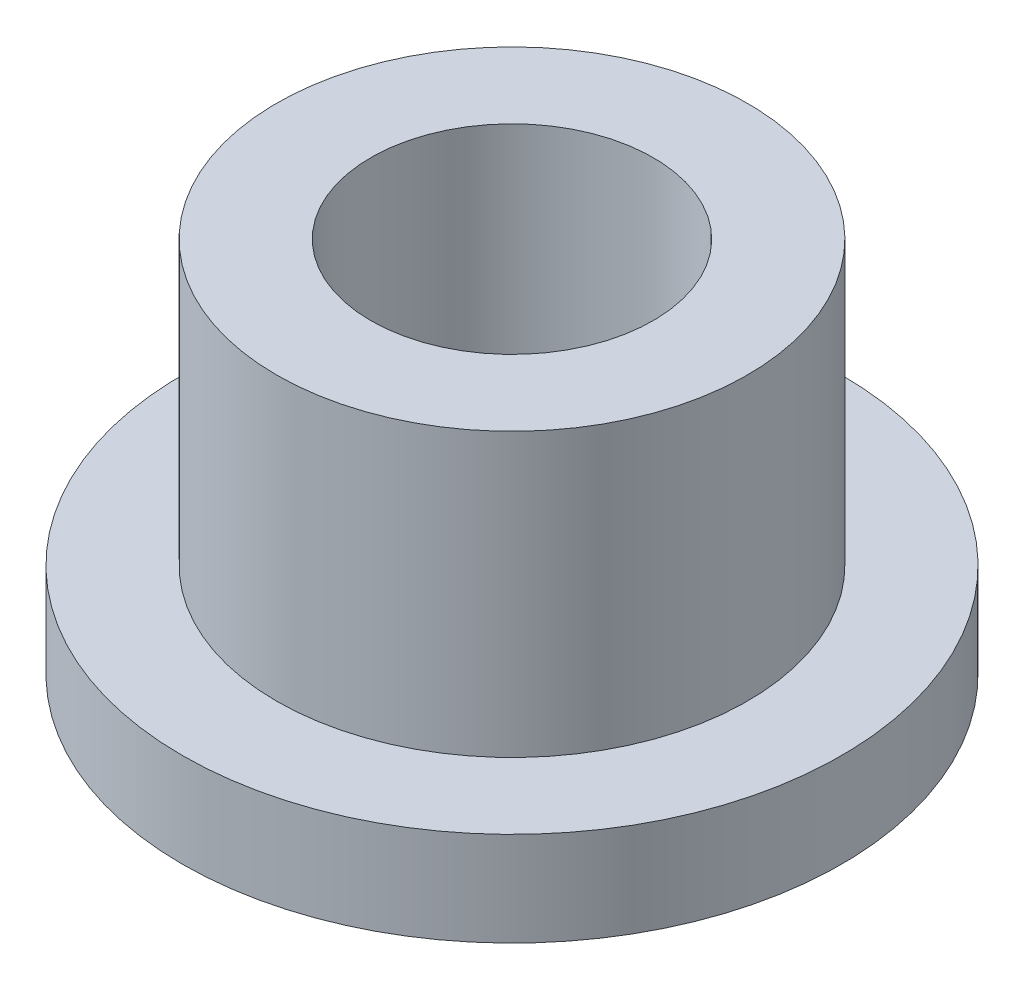
ISO-10303-21;
HEADER;
FILE_DESCRIPTION(('STEP AP214'),'2;1');
FILE_NAME('part.step','',(''),(''),'','','');
FILE_SCHEMA(('AUTOMOTIVE_DESIGN { 1 0 10303 214 1 1 1 1 }'));
ENDSEC;
DATA;
#1=APPLICATION_CONTEXT('core data for automotive mechanical design processes');
#2=APPLICATION_PROTOCOL_DEFINITION('international standard','automotive_design',2000,#1);
#3=PRODUCT_CONTEXT('',#1,'mechanical');
#4=PRODUCT('Part','Part','',(#3));
#5=PRODUCT_RELATED_PRODUCT_CATEGORY('part','',(#4));
#6=PRODUCT_DEFINITION_FORMATION('','',#4);
#7=PRODUCT_DEFINITION_CONTEXT('part definition',#1,'design');
#8=PRODUCT_DEFINITION('design','',#6,#7);
#9=PRODUCT_DEFINITION_SHAPE('','',#8);
#10=(LENGTH_UNIT() NAMED_UNIT(*) SI_UNIT(.MILLI.,.METRE.));
#11=(NAMED_UNIT(*) PLANE_ANGLE_UNIT() SI_UNIT($,.RADIAN.));
#12=(NAMED_UNIT(*) SI_UNIT($,.STERADIAN.) SOLID_ANGLE_UNIT());
#13=UNCERTAINTY_MEASURE_WITH_UNIT(LENGTH_MEASURE(1.E-05),#10,'distance_accuracy_value','');
#14=(GEOMETRIC_REPRESENTATION_CONTEXT(3) GLOBAL_UNCERTAINTY_ASSIGNED_CONTEXT((#13)) GLOBAL_UNIT_ASSIGNED_CONTEXT((#10,
#11,#12)) REPRESENTATION_CONTEXT('',''));
#15=CARTESIAN_POINT('',(0.,0.,0.));
#16=DIRECTION('',(0.,0.,1.));
#17=DIRECTION('',(1.,0.,0.));
#18=AXIS2_PLACEMENT_3D('',#15,#16,#17);
#19=CARTESIAN_POINT('',(0.,6.35,0.));
#20=DIRECTION('',(0.,1.,0.));
#21=DIRECTION('',(0.,0.,1.));
#22=AXIS2_PLACEMENT_3D('',#19,#20,#21);
#23=PLANE('',#22);
#24=CARTESIAN_POINT('',(0.,6.35,0.));
#25=DIRECTION('',(0.,1.,0.));
#26=DIRECTION('',(0.,0.,1.));
#27=AXIS2_PLACEMENT_3D('',#24,#25,#26);
#28=CIRCLE('',#27,3.96875);
#29=CARTESIAN_POINT('',(0.,6.35,3.96875));
#30=VERTEX_POINT('',#29);
#31=EDGE_CURVE('E10',#30,#30,#28,.T.);
#32=ORIENTED_EDGE('',*,*,#31,.T.);
#33=EDGE_LOOP('',(#32));
#34=FACE_BOUND('',#33,.T.);
#35=CARTESIAN_POINT('',(0.,6.35,0.));
#36=DIRECTION('',(0.,1.,0.));
#37=DIRECTION('',(0.,0.,1.));
#38=AXIS2_PLACEMENT_3D('',#35,#36,#37);
#39=CIRCLE('',#38,2.38125);
#40=CARTESIAN_POINT('',(0.,6.35,2.38125));
#41=VERTEX_POINT('',#40);
#42=EDGE_CURVE('E39',#41,#41,#39,.T.);
#43=ORIENTED_EDGE('',*,*,#42,.F.);
#44=EDGE_LOOP('',(#43));
#45=FACE_BOUND('',#44,.T.);
#46=ADVANCED_FACE('F32',(#34,#45),#23,.T.);
#47=CARTESIAN_POINT('',(0.,0.,0.));
#48=DIRECTION('',(0.,1.,0.));
#49=DIRECTION('',(0.,0.,1.));
#50=AXIS2_PLACEMENT_3D('',#47,#48,#49);
#51=PLANE('',#50);
#52=CARTESIAN_POINT('',(0.,0.,0.));
#53=DIRECTION('',(0.,1.,0.));
#54=DIRECTION('',(0.,0.,1.));
#55=AXIS2_PLACEMENT_3D('',#52,#53,#54);
#56=CIRCLE('',#55,2.38125);
#57=CARTESIAN_POINT('',(0.,0.,2.38125));
#58=VERTEX_POINT('',#57);
#59=EDGE_CURVE('E43',#58,#58,#56,.T.);
#60=ORIENTED_EDGE('',*,*,#59,.T.);
#61=EDGE_LOOP('',(#60));
#62=FACE_BOUND('',#61,.T.);
#63=CARTESIAN_POINT('',(0.,0.,0.));
#64=DIRECTION('',(0.,1.,0.));
#65=DIRECTION('',(0.,0.,1.));
#66=AXIS2_PLACEMENT_3D('',#63,#64,#65);
#67=CIRCLE('',#66,5.55625);
#68=CARTESIAN_POINT('',(0.,0.,5.55625));
#69=VERTEX_POINT('',#68);
#70=EDGE_CURVE('E50',#69,#69,#67,.T.);
#71=ORIENTED_EDGE('',*,*,#70,.F.);
#72=EDGE_LOOP('',(#71));
#73=FACE_BOUND('',#72,.T.);
#74=ADVANCED_FACE('F75',(#62,#73),#51,.F.);
#75=CARTESIAN_POINT('',(0.,6.35,0.));
#76=DIRECTION('',(0.,-1.,0.));
#77=DIRECTION('',(0.,0.,-1.));
#78=AXIS2_PLACEMENT_3D('',#75,#76,#77);
#79=CYLINDRICAL_SURFACE('',#78,3.96875);
#80=CARTESIAN_POINT('',(0.,1.5875,0.));
#81=DIRECTION('',(0.,1.,0.));
#82=DIRECTION('',(0.,0.,1.));
#83=AXIS2_PLACEMENT_3D('',#80,#81,#82);
#84=CIRCLE('',#83,3.96875);
#85=CARTESIAN_POINT('',(0.,1.5875,3.96875));
#86=VERTEX_POINT('',#85);
#87=EDGE_CURVE('E53',#86,#86,#84,.T.);
#88=ORIENTED_EDGE('',*,*,#87,.T.);
#89=EDGE_LOOP('',(#88));
#90=FACE_BOUND('',#89,.T.);
#91=ORIENTED_EDGE('',*,*,#31,.F.);
#92=EDGE_LOOP('',(#91));
#93=FACE_BOUND('',#92,.T.);
#94=ADVANCED_FACE('F34',(#90,#93),#79,.T.);
#95=CARTESIAN_POINT('',(0.,6.35,0.));
#96=DIRECTION('',(0.,-1.,0.));
#97=DIRECTION('',(0.,0.,-1.));
#98=AXIS2_PLACEMENT_3D('',#95,#96,#97);
#99=CYLINDRICAL_SURFACE('',#98,2.38125);
#100=ORIENTED_EDGE('',*,*,#42,.T.);
#101=EDGE_LOOP('',(#100));
#102=FACE_BOUND('',#101,.T.);
#103=ORIENTED_EDGE('',*,*,#59,.F.);
#104=EDGE_LOOP('',(#103));
#105=FACE_BOUND('',#104,.T.);
#106=ADVANCED_FACE('F64',(#102,#105),#99,.F.);
#107=CARTESIAN_POINT('',(0.,1.5875,0.));
#108=DIRECTION('',(0.,1.,0.));
#109=DIRECTION('',(0.,0.,1.));
#110=AXIS2_PLACEMENT_3D('',#107,#108,#109);
#111=PLANE('',#110);
#112=CARTESIAN_POINT('',(0.,1.5875,0.));
#113=DIRECTION('',(0.,1.,0.));
#114=DIRECTION('',(0.,0.,1.));
#115=AXIS2_PLACEMENT_3D('',#112,#113,#114);
#116=CIRCLE('',#115,5.55625);
#117=CARTESIAN_POINT('',(0.,1.5875,5.55625));
#118=VERTEX_POINT('',#117);
#119=EDGE_CURVE('E48',#118,#118,#116,.T.);
#120=ORIENTED_EDGE('',*,*,#119,.T.);
#121=EDGE_LOOP('',(#120));
#122=FACE_BOUND('',#121,.T.);
#123=ORIENTED_EDGE('',*,*,#87,.F.);
#124=EDGE_LOOP('',(#123));
#125=FACE_BOUND('',#124,.T.);
#126=ADVANCED_FACE('F61',(#122,#125),#111,.T.);
#127=CARTESIAN_POINT('',(0.,1.5875,0.));
#128=DIRECTION('',(0.,-1.,0.));
#129=DIRECTION('',(0.,0.,-1.));
#130=AXIS2_PLACEMENT_3D('',#127,#128,#129);
#131=CYLINDRICAL_SURFACE('',#130,5.55625);
#132=ORIENTED_EDGE('',*,*,#119,.F.);
#133=EDGE_LOOP('',(#132));
#134=FACE_BOUND('',#133,.T.);
#135=ORIENTED_EDGE('',*,*,#70,.T.);
#136=EDGE_LOOP('',(#135));
#137=FACE_BOUND('',#136,.T.);
#138=ADVANCED_FACE('F63',(#134,#137),#131,.T.);
#139=CLOSED_SHELL('',(#46,#74,#94,#106,#126,#138));
#140=MANIFOLD_SOLID_BREP('B2',#139);
#141=ADVANCED_BREP_SHAPE_REPRESENTATION('',(#18,#140),#14);
#142=SHAPE_DEFINITION_REPRESENTATION(#9,#141);
ENDSEC;
END-ISO-10303-21;
